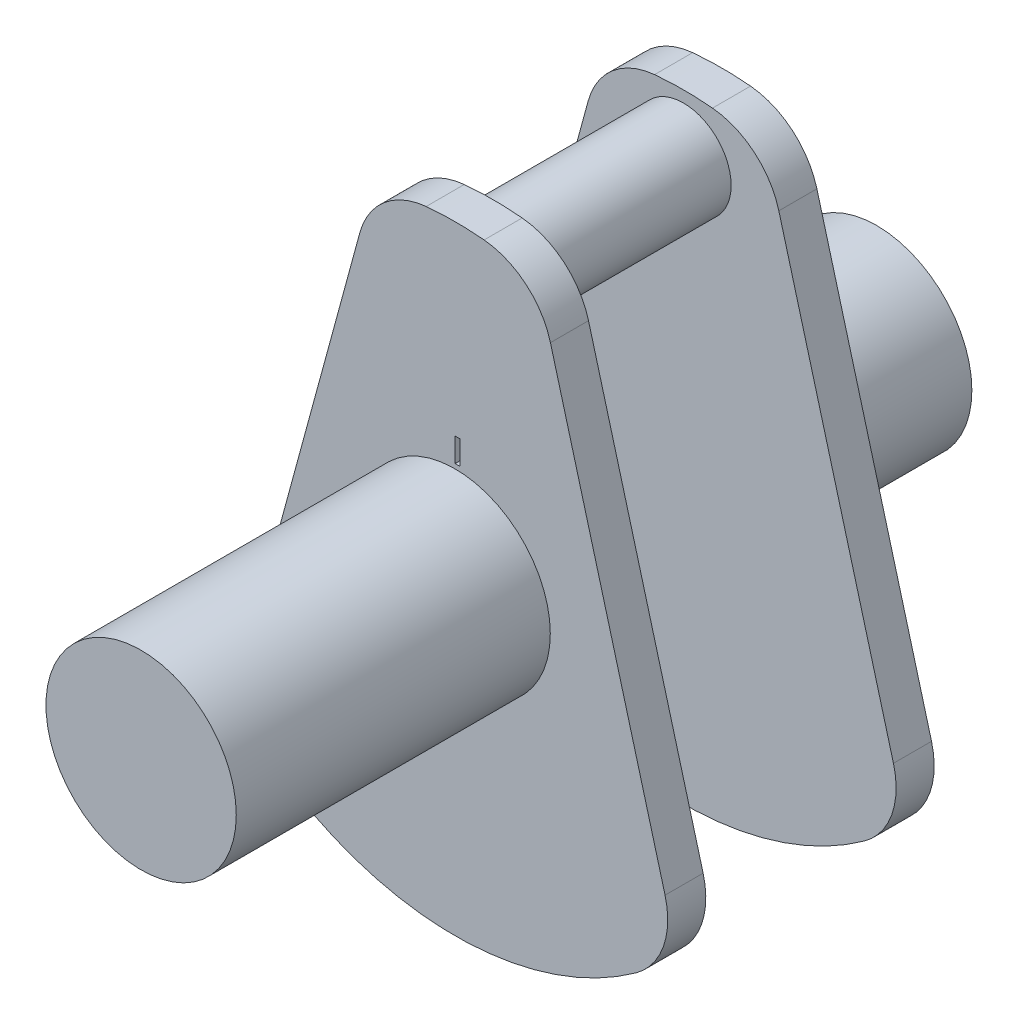
ISO-10303-21;
HEADER;
FILE_DESCRIPTION(('STEP AP214'),'2;1');
FILE_NAME('part.step','',(''),(''),'','','');
FILE_SCHEMA(('AUTOMOTIVE_DESIGN { 1 0 10303 214 1 1 1 1 }'));
ENDSEC;
DATA;
#1=APPLICATION_CONTEXT('core data for automotive mechanical design processes');
#2=APPLICATION_PROTOCOL_DEFINITION('international standard','automotive_design',2000,#1);
#3=PRODUCT_CONTEXT('',#1,'mechanical');
#4=PRODUCT('Part','Part','',(#3));
#5=PRODUCT_RELATED_PRODUCT_CATEGORY('part','',(#4));
#6=PRODUCT_DEFINITION_FORMATION('','',#4);
#7=PRODUCT_DEFINITION_CONTEXT('part definition',#1,'design');
#8=PRODUCT_DEFINITION('design','',#6,#7);
#9=PRODUCT_DEFINITION_SHAPE('','',#8);
#10=(LENGTH_UNIT() NAMED_UNIT(*) SI_UNIT(.MILLI.,.METRE.));
#11=(NAMED_UNIT(*) PLANE_ANGLE_UNIT() SI_UNIT($,.RADIAN.));
#12=(NAMED_UNIT(*) SI_UNIT($,.STERADIAN.) SOLID_ANGLE_UNIT());
#13=UNCERTAINTY_MEASURE_WITH_UNIT(LENGTH_MEASURE(1.E-05),#10,'distance_accuracy_value','');
#14=(GEOMETRIC_REPRESENTATION_CONTEXT(3) GLOBAL_UNCERTAINTY_ASSIGNED_CONTEXT((#13)) GLOBAL_UNIT_ASSIGNED_CONTEXT((#10,
#11,#12)) REPRESENTATION_CONTEXT('',''));
#15=CARTESIAN_POINT('',(0.,0.,0.));
#16=DIRECTION('',(0.,0.,1.));
#17=DIRECTION('',(1.,0.,0.));
#18=AXIS2_PLACEMENT_3D('',#15,#16,#17);
#19=CARTESIAN_POINT('',(0.459000000000004,3.78337793824868,36.9249720179287));
#20=DIRECTION('',(0.,0.,-1.));
#21=DIRECTION('',(-1.,0.,0.));
#22=AXIS2_PLACEMENT_3D('',#19,#20,#21);
#23=CYLINDRICAL_SURFACE('',#22,1.6);
#24=CARTESIAN_POINT('',(0.459000000000004,3.78337793824868,36.1249720179287));
#25=DIRECTION('',(0.,0.,1.));
#26=DIRECTION('',(1.,0.,0.));
#27=AXIS2_PLACEMENT_3D('',#24,#25,#26);
#28=CIRCLE('',#27,1.6);
#29=CARTESIAN_POINT('',(2.00284320160388,4.20355429272558,36.1249720179287));
#30=VERTEX_POINT('',#29);
#31=CARTESIAN_POINT('',(0.608877551020411,5.37634269608236,36.1249720179287));
#32=VERTEX_POINT('',#31);
#33=EDGE_CURVE('E156',#30,#32,#28,.T.);
#34=ORIENTED_EDGE('',*,*,#33,.T.);
#35=DIRECTION('',(0.,0.,-1.));
#36=VECTOR('',#35,1.);
#37=CARTESIAN_POINT('',(0.608877551020411,5.37634269608236,36.9249720179287));
#38=LINE('',#37,#36);
#39=CARTESIAN_POINT('',(0.608877551020411,5.37634269608236,36.9249720179287));
#40=VERTEX_POINT('',#39);
#41=EDGE_CURVE('E50',#40,#32,#38,.T.);
#42=ORIENTED_EDGE('',*,*,#41,.F.);
#43=CARTESIAN_POINT('',(0.459000000000004,3.78337793824868,36.9249720179287));
#44=DIRECTION('',(0.,0.,1.));
#45=DIRECTION('',(1.,0.,0.));
#46=AXIS2_PLACEMENT_3D('',#43,#44,#45);
#47=CIRCLE('',#46,1.6);
#48=CARTESIAN_POINT('',(2.00284320160388,4.20355429272558,36.9249720179287));
#49=VERTEX_POINT('',#48);
#50=EDGE_CURVE('E180',#49,#40,#47,.T.);
#51=ORIENTED_EDGE('',*,*,#50,.F.);
#52=DIRECTION('',(0.,0.,-1.));
#53=VECTOR('',#52,1.);
#54=CARTESIAN_POINT('',(2.00284320160388,4.20355429272558,36.9249720179287));
#55=LINE('',#54,#53);
#56=EDGE_CURVE('E152',#49,#30,#55,.T.);
#57=ORIENTED_EDGE('',*,*,#56,.T.);
#58=EDGE_LOOP('',(#34,#42,#51,#57));
#59=FACE_BOUND('',#58,.T.);
#60=ADVANCED_FACE('F42',(#59),#23,.T.);
#61=CARTESIAN_POINT('',(0.,-1.09507663261698,36.9249720179287));
#62=DIRECTION('',(0.,0.,-1.));
#63=DIRECTION('',(-1.,0.,0.));
#64=AXIS2_PLACEMENT_3D('',#61,#62,#63);
#65=CYLINDRICAL_SURFACE('',#64,6.5);
#66=CARTESIAN_POINT('',(0.,-1.09507663261698,36.1249720179287));
#67=DIRECTION('',(0.,0.,1.));
#68=DIRECTION('',(1.,0.,0.));
#69=AXIS2_PLACEMENT_3D('',#66,#67,#68);
#70=CIRCLE('',#69,6.5);
#71=CARTESIAN_POINT('',(-0.608877551020403,5.37634269608236,36.1249720179287));
#72=VERTEX_POINT('',#71);
#73=EDGE_CURVE('E160',#32,#72,#70,.T.);
#74=ORIENTED_EDGE('',*,*,#73,.T.);
#75=DIRECTION('',(0.,0.,-1.));
#76=VECTOR('',#75,1.);
#77=CARTESIAN_POINT('',(-0.608877551020403,5.37634269608236,36.9249720179287));
#78=LINE('',#77,#76);
#79=CARTESIAN_POINT('',(-0.608877551020403,5.37634269608236,36.9249720179287));
#80=VERTEX_POINT('',#79);
#81=EDGE_CURVE('E195',#80,#72,#78,.T.);
#82=ORIENTED_EDGE('',*,*,#81,.F.);
#83=CARTESIAN_POINT('',(0.,-1.09507663261698,36.9249720179287));
#84=DIRECTION('',(0.,0.,1.));
#85=DIRECTION('',(1.,0.,0.));
#86=AXIS2_PLACEMENT_3D('',#83,#84,#85);
#87=CIRCLE('',#86,6.5);
#88=EDGE_CURVE('E108',#40,#80,#87,.T.);
#89=ORIENTED_EDGE('',*,*,#88,.F.);
#90=ORIENTED_EDGE('',*,*,#41,.T.);
#91=EDGE_LOOP('',(#74,#82,#89,#90));
#92=FACE_BOUND('',#91,.T.);
#93=ADVANCED_FACE('F200',(#92),#65,.T.);
#94=CARTESIAN_POINT('',(-0.458999999999996,3.78337793824868,36.9249720179287));
#95=DIRECTION('',(0.,0.,-1.));
#96=DIRECTION('',(-1.,0.,0.));
#97=AXIS2_PLACEMENT_3D('',#94,#95,#96);
#98=CYLINDRICAL_SURFACE('',#97,1.6);
#99=CARTESIAN_POINT('',(-0.458999999999996,3.78337793824868,36.1249720179287));
#100=DIRECTION('',(0.,0.,1.));
#101=DIRECTION('',(-1.,0.,0.));
#102=AXIS2_PLACEMENT_3D('',#99,#100,#101);
#103=CIRCLE('',#102,1.6);
#104=CARTESIAN_POINT('',(-2.00284320160387,4.20355429272557,36.1249720179287));
#105=VERTEX_POINT('',#104);
#106=EDGE_CURVE('E164',#72,#105,#103,.T.);
#107=ORIENTED_EDGE('',*,*,#106,.T.);
#108=DIRECTION('',(0.,0.,-1.));
#109=VECTOR('',#108,1.);
#110=CARTESIAN_POINT('',(-2.00284320160387,4.20355429272557,36.9249720179287));
#111=LINE('',#110,#109);
#112=CARTESIAN_POINT('',(-2.00284320160387,4.20355429272557,36.9249720179287));
#113=VERTEX_POINT('',#112);
#114=EDGE_CURVE('E191',#113,#105,#111,.T.);
#115=ORIENTED_EDGE('',*,*,#114,.F.);
#116=CARTESIAN_POINT('',(-0.458999999999996,3.78337793824868,36.9249720179287));
#117=DIRECTION('',(0.,0.,1.));
#118=DIRECTION('',(-1.,0.,0.));
#119=AXIS2_PLACEMENT_3D('',#116,#117,#118);
#120=CIRCLE('',#119,1.6);
#121=EDGE_CURVE('E219',#80,#113,#120,.T.);
#122=ORIENTED_EDGE('',*,*,#121,.F.);
#123=ORIENTED_EDGE('',*,*,#81,.T.);
#124=EDGE_LOOP('',(#107,#115,#122,#123));
#125=FACE_BOUND('',#124,.T.);
#126=ADVANCED_FACE('F211',(#125),#98,.T.);
#127=CARTESIAN_POINT('',(-2.00284320160387,4.20355429272557,36.9249720179287));
#128=DIRECTION('',(0.964902001002423,-0.26261022154806,0.));
#129=DIRECTION('',(0.26261022154806,0.964902001002423,0.));
#130=AXIS2_PLACEMENT_3D('',#127,#128,#129);
#131=PLANE('',#130);
#132=DIRECTION('',(-0.26261022154806,-0.964902001002423,0.));
#133=VECTOR('',#132,1.);
#134=CARTESIAN_POINT('',(-2.00284320160387,4.20355429272557,36.1249720179287));
#135=LINE('',#134,#133);
#136=CARTESIAN_POINT('',(-4.41186786120332,-4.64786322182952,36.1249720179287));
#137=VERTEX_POINT('',#136);
#138=EDGE_CURVE('E167',#105,#137,#135,.T.);
#139=ORIENTED_EDGE('',*,*,#138,.T.);
#140=DIRECTION('',(0.,0.,-1.));
#141=VECTOR('',#140,1.);
#142=CARTESIAN_POINT('',(-4.41186786120332,-4.64786322182952,36.9249720179287));
#143=LINE('',#142,#141);
#144=CARTESIAN_POINT('',(-4.41186786120332,-4.64786322182952,36.9249720179287));
#145=VERTEX_POINT('',#144);
#146=EDGE_CURVE('E187',#145,#137,#143,.T.);
#147=ORIENTED_EDGE('',*,*,#146,.F.);
#148=DIRECTION('',(-0.26261022154806,-0.964902001002423,0.));
#149=VECTOR('',#148,1.);
#150=CARTESIAN_POINT('',(-2.00284320160387,4.20355429272557,36.9249720179287));
#151=LINE('',#150,#149);
#152=EDGE_CURVE('E217',#113,#145,#151,.T.);
#153=ORIENTED_EDGE('',*,*,#152,.F.);
#154=ORIENTED_EDGE('',*,*,#114,.T.);
#155=EDGE_LOOP('',(#139,#147,#153,#154));
#156=FACE_BOUND('',#155,.T.);
#157=ADVANCED_FACE('F215',(#156),#131,.F.);
#158=CARTESIAN_POINT('',(-2.86802465959945,-5.06803957630642,36.9249720179287));
#159=DIRECTION('',(0.,0.,-1.));
#160=DIRECTION('',(-1.,0.,0.));
#161=AXIS2_PLACEMENT_3D('',#158,#159,#160);
#162=CYLINDRICAL_SURFACE('',#161,1.6);
#163=CARTESIAN_POINT('',(-2.86802465959945,-5.06803957630642,36.1249720179287));
#164=DIRECTION('',(0.,0.,1.));
#165=DIRECTION('',(1.,0.,0.));
#166=AXIS2_PLACEMENT_3D('',#163,#164,#165);
#167=CIRCLE('',#166,1.6);
#168=CARTESIAN_POINT('',(-3.80452250763193,-6.36533359873562,36.1249720179287));
#169=VERTEX_POINT('',#168);
#170=EDGE_CURVE('E170',#137,#169,#167,.T.);
#171=ORIENTED_EDGE('',*,*,#170,.T.);
#172=DIRECTION('',(0.,0.,-1.));
#173=VECTOR('',#172,1.);
#174=CARTESIAN_POINT('',(-3.80452250763193,-6.36533359873562,36.9249720179287));
#175=LINE('',#174,#173);
#176=CARTESIAN_POINT('',(-3.80452250763193,-6.36533359873562,36.9249720179287));
#177=VERTEX_POINT('',#176);
#178=EDGE_CURVE('E145',#177,#169,#175,.T.);
#179=ORIENTED_EDGE('',*,*,#178,.F.);
#180=CARTESIAN_POINT('',(-2.86802465959945,-5.06803957630642,36.9249720179287));
#181=DIRECTION('',(0.,0.,1.));
#182=DIRECTION('',(1.,0.,0.));
#183=AXIS2_PLACEMENT_3D('',#180,#181,#182);
#184=CIRCLE('',#183,1.6);
#185=EDGE_CURVE('E131',#145,#177,#184,.T.);
#186=ORIENTED_EDGE('',*,*,#185,.F.);
#187=ORIENTED_EDGE('',*,*,#146,.T.);
#188=EDGE_LOOP('',(#171,#179,#186,#187));
#189=FACE_BOUND('',#188,.T.);
#190=ADVANCED_FACE('F506',(#189),#162,.T.);
#191=CARTESIAN_POINT('',(0.,-1.09507663261698,36.9249720179287));
#192=DIRECTION('',(0.,0.,-1.));
#193=DIRECTION('',(-1.,0.,0.));
#194=AXIS2_PLACEMENT_3D('',#191,#192,#193);
#195=CYLINDRICAL_SURFACE('',#194,6.5);
#196=CARTESIAN_POINT('',(0.,-1.09507663261698,36.1249720179287));
#197=DIRECTION('',(0.,0.,1.));
#198=DIRECTION('',(1.,0.,0.));
#199=AXIS2_PLACEMENT_3D('',#196,#197,#198);
#200=CIRCLE('',#199,6.5);
#201=CARTESIAN_POINT('',(3.80452250763193,-6.36533359873562,36.1249720179287));
#202=VERTEX_POINT('',#201);
#203=EDGE_CURVE('E141',#169,#202,#200,.T.);
#204=ORIENTED_EDGE('',*,*,#203,.T.);
#205=DIRECTION('',(0.,0.,-1.));
#206=VECTOR('',#205,1.);
#207=CARTESIAN_POINT('',(3.80452250763193,-6.36533359873562,36.9249720179287));
#208=LINE('',#207,#206);
#209=CARTESIAN_POINT('',(3.80452250763193,-6.36533359873562,36.9249720179287));
#210=VERTEX_POINT('',#209);
#211=EDGE_CURVE('E138',#210,#202,#208,.T.);
#212=ORIENTED_EDGE('',*,*,#211,.F.);
#213=CARTESIAN_POINT('',(0.,-1.09507663261698,36.9249720179287));
#214=DIRECTION('',(0.,0.,1.));
#215=DIRECTION('',(1.,0.,0.));
#216=AXIS2_PLACEMENT_3D('',#213,#214,#215);
#217=CIRCLE('',#216,6.5);
#218=EDGE_CURVE('E124',#177,#210,#217,.T.);
#219=ORIENTED_EDGE('',*,*,#218,.F.);
#220=ORIENTED_EDGE('',*,*,#178,.T.);
#221=EDGE_LOOP('',(#204,#212,#219,#220));
#222=FACE_BOUND('',#221,.T.);
#223=ADVANCED_FACE('F139',(#222),#195,.T.);
#224=CARTESIAN_POINT('',(2.86802465959946,-5.06803957630641,36.9249720179287));
#225=DIRECTION('',(0.,0.,-1.));
#226=DIRECTION('',(-1.,0.,0.));
#227=AXIS2_PLACEMENT_3D('',#224,#225,#226);
#228=CYLINDRICAL_SURFACE('',#227,1.6);
#229=CARTESIAN_POINT('',(2.86802465959946,-5.06803957630641,36.1249720179287));
#230=DIRECTION('',(0.,0.,1.));
#231=DIRECTION('',(-1.,0.,0.));
#232=AXIS2_PLACEMENT_3D('',#229,#230,#231);
#233=CIRCLE('',#232,1.6);
#234=CARTESIAN_POINT('',(4.41186786120333,-4.64786322182952,36.1249720179287));
#235=VERTEX_POINT('',#234);
#236=EDGE_CURVE('E175',#202,#235,#233,.T.);
#237=ORIENTED_EDGE('',*,*,#236,.T.);
#238=DIRECTION('',(0.,0.,-1.));
#239=VECTOR('',#238,1.);
#240=CARTESIAN_POINT('',(4.41186786120333,-4.64786322182952,36.9249720179287));
#241=LINE('',#240,#239);
#242=CARTESIAN_POINT('',(4.41186786120333,-4.64786322182952,36.9249720179287));
#243=VERTEX_POINT('',#242);
#244=EDGE_CURVE('E146',#243,#235,#241,.T.);
#245=ORIENTED_EDGE('',*,*,#244,.F.);
#246=CARTESIAN_POINT('',(2.86802465959946,-5.06803957630641,36.9249720179287));
#247=DIRECTION('',(0.,0.,1.));
#248=DIRECTION('',(-1.,0.,0.));
#249=AXIS2_PLACEMENT_3D('',#246,#247,#248);
#250=CIRCLE('',#249,1.6);
#251=EDGE_CURVE('E128',#210,#243,#250,.T.);
#252=ORIENTED_EDGE('',*,*,#251,.F.);
#253=ORIENTED_EDGE('',*,*,#211,.T.);
#254=EDGE_LOOP('',(#237,#245,#252,#253));
#255=FACE_BOUND('',#254,.T.);
#256=ADVANCED_FACE('F148',(#255),#228,.T.);
#257=CARTESIAN_POINT('',(2.00284320160388,4.20355429272558,36.9249720179287));
#258=DIRECTION('',(-0.964902001002423,-0.26261022154806,0.));
#259=DIRECTION('',(0.26261022154806,-0.964902001002423,0.));
#260=AXIS2_PLACEMENT_3D('',#257,#258,#259);
#261=PLANE('',#260);
#262=DIRECTION('',(-0.26261022154806,0.964902001002423,0.));
#263=VECTOR('',#262,1.);
#264=CARTESIAN_POINT('',(2.00284320160388,4.20355429272558,36.1249720179287));
#265=LINE('',#264,#263);
#266=EDGE_CURVE('E99',#235,#30,#265,.T.);
#267=ORIENTED_EDGE('',*,*,#266,.T.);
#268=ORIENTED_EDGE('',*,*,#56,.F.);
#269=DIRECTION('',(-0.26261022154806,0.964902001002423,0.));
#270=VECTOR('',#269,1.);
#271=CARTESIAN_POINT('',(2.00284320160388,4.20355429272558,36.9249720179287));
#272=LINE('',#271,#270);
#273=EDGE_CURVE('E66',#243,#49,#272,.T.);
#274=ORIENTED_EDGE('',*,*,#273,.F.);
#275=ORIENTED_EDGE('',*,*,#244,.T.);
#276=EDGE_LOOP('',(#267,#268,#274,#275));
#277=FACE_BOUND('',#276,.T.);
#278=ADVANCED_FACE('F514',(#277),#261,.F.);
#279=CARTESIAN_POINT('',(0.459000000000004,3.78337793824868,36.9249720179287));
#280=DIRECTION('',(0.,0.,1.));
#281=DIRECTION('',(1.,0.,0.));
#282=AXIS2_PLACEMENT_3D('',#279,#280,#281);
#283=PLANE('',#282);
#284=CARTESIAN_POINT('',(0.,4.16392336738302,36.9249720179287));
#285=DIRECTION('',(0.,0.,1.));
#286=DIRECTION('',(1.,0.,0.));
#287=AXIS2_PLACEMENT_3D('',#284,#285,#286);
#288=CIRCLE('',#287,1.);
#289=CARTESIAN_POINT('',(1.00000000000001,4.16392336738302,36.9249720179287));
#290=VERTEX_POINT('',#289);
#291=EDGE_CURVE('E161',#290,#290,#288,.T.);
#292=ORIENTED_EDGE('',*,*,#291,.F.);
#293=EDGE_LOOP('',(#292));
#294=FACE_BOUND('',#293,.T.);
#295=ORIENTED_EDGE('',*,*,#50,.T.);
#296=ORIENTED_EDGE('',*,*,#88,.T.);
#297=ORIENTED_EDGE('',*,*,#121,.T.);
#298=ORIENTED_EDGE('',*,*,#152,.T.);
#299=ORIENTED_EDGE('',*,*,#185,.T.);
#300=ORIENTED_EDGE('',*,*,#218,.T.);
#301=ORIENTED_EDGE('',*,*,#251,.T.);
#302=ORIENTED_EDGE('',*,*,#273,.T.);
#303=EDGE_LOOP('',(#295,#296,#297,#298,#299,#300,#301,#302));
#304=FACE_BOUND('',#303,.T.);
#305=ADVANCED_FACE('F126',(#294,#304),#283,.T.);
#306=CARTESIAN_POINT('',(0.459000000000004,3.78337793824868,36.1249720179287));
#307=DIRECTION('',(0.,0.,1.));
#308=DIRECTION('',(1.,0.,0.));
#309=AXIS2_PLACEMENT_3D('',#306,#307,#308);
#310=PLANE('',#309);
#311=CARTESIAN_POINT('',(0.,-1.09507663261698,36.1249720179287));
#312=DIRECTION('',(0.,0.,1.));
#313=DIRECTION('',(1.,0.,0.));
#314=AXIS2_PLACEMENT_3D('',#311,#312,#313);
#315=CIRCLE('',#314,2.);
#316=CARTESIAN_POINT('',(2.,-1.09507663261698,36.1249720179287));
#317=VERTEX_POINT('',#316);
#318=EDGE_CURVE('E11',#317,#317,#315,.F.);
#319=ORIENTED_EDGE('',*,*,#318,.F.);
#320=EDGE_LOOP('',(#319));
#321=FACE_BOUND('',#320,.T.);
#322=ORIENTED_EDGE('',*,*,#33,.F.);
#323=ORIENTED_EDGE('',*,*,#266,.F.);
#324=ORIENTED_EDGE('',*,*,#236,.F.);
#325=ORIENTED_EDGE('',*,*,#203,.F.);
#326=ORIENTED_EDGE('',*,*,#170,.F.);
#327=ORIENTED_EDGE('',*,*,#138,.F.);
#328=ORIENTED_EDGE('',*,*,#106,.F.);
#329=ORIENTED_EDGE('',*,*,#73,.F.);
#330=EDGE_LOOP('',(#322,#323,#324,#325,#326,#327,#328,#329));
#331=FACE_BOUND('',#330,.T.);
#332=ADVANCED_FACE('F205',(#321,#331),#310,.F.);
#333=CARTESIAN_POINT('',(0.,4.16392336738302,38.9249720179287));
#334=DIRECTION('',(0.,0.,-1.));
#335=DIRECTION('',(-1.,0.,0.));
#336=AXIS2_PLACEMENT_3D('',#333,#334,#335);
#337=CYLINDRICAL_SURFACE('',#336,1.);
#338=ORIENTED_EDGE('',*,*,#291,.T.);
#339=EDGE_LOOP('',(#338));
#340=FACE_BOUND('',#339,.T.);
#341=CARTESIAN_POINT('',(0.,4.16392336738302,40.9249720179287));
#342=DIRECTION('',(0.,0.,1.));
#343=DIRECTION('',(1.,0.,0.));
#344=AXIS2_PLACEMENT_3D('',#341,#342,#343);
#345=CIRCLE('',#344,1.);
#346=CARTESIAN_POINT('',(1.00000000000001,4.16392336738302,40.9249720179287));
#347=VERTEX_POINT('',#346);
#348=EDGE_CURVE('E306',#347,#347,#345,.T.);
#349=ORIENTED_EDGE('',*,*,#348,.F.);
#350=EDGE_LOOP('',(#349));
#351=FACE_BOUND('',#350,.T.);
#352=ADVANCED_FACE('F519',(#340,#351),#337,.T.);
#353=CARTESIAN_POINT('',(0.,-1.09507663261698,32.8649720179287));
#354=DIRECTION('',(0.,0.,1.));
#355=DIRECTION('',(1.,0.,0.));
#356=AXIS2_PLACEMENT_3D('',#353,#354,#355);
#357=CYLINDRICAL_SURFACE('',#356,2.);
#358=CARTESIAN_POINT('',(0.,-1.09507663261698,32.8649720179287));
#359=DIRECTION('',(0.,0.,-1.));
#360=DIRECTION('',(-1.,0.,0.));
#361=AXIS2_PLACEMENT_3D('',#358,#359,#360);
#362=CIRCLE('',#361,2.);
#363=CARTESIAN_POINT('',(-2.,-1.09507663261698,32.8649720179287));
#364=VERTEX_POINT('',#363);
#365=EDGE_CURVE('E232',#364,#364,#362,.T.);
#366=ORIENTED_EDGE('',*,*,#365,.F.);
#367=EDGE_LOOP('',(#366));
#368=FACE_BOUND('',#367,.T.);
#369=ORIENTED_EDGE('',*,*,#318,.T.);
#370=EDGE_LOOP('',(#369));
#371=FACE_BOUND('',#370,.T.);
#372=ADVANCED_FACE('F526',(#368,#371),#357,.T.);
#373=CARTESIAN_POINT('',(0.,-1.09507663261698,32.8649720179287));
#374=DIRECTION('',(0.,0.,-1.));
#375=DIRECTION('',(-1.,0.,0.));
#376=AXIS2_PLACEMENT_3D('',#373,#374,#375);
#377=PLANE('',#376);
#378=ORIENTED_EDGE('',*,*,#365,.T.);
#379=EDGE_LOOP('',(#378));
#380=FACE_BOUND('',#379,.T.);
#381=ADVANCED_FACE('F530',(#380),#377,.T.);
#382=CARTESIAN_POINT('',(0.459000000000004,3.78337793824868,40.9249720179287));
#383=DIRECTION('',(0.,0.,1.));
#384=DIRECTION('',(-1.,0.,0.));
#385=AXIS2_PLACEMENT_3D('',#382,#383,#384);
#386=CYLINDRICAL_SURFACE('',#385,1.6);
#387=CARTESIAN_POINT('',(0.459000000000004,3.78337793824868,41.7249720179287));
#388=DIRECTION('',(0.,0.,1.));
#389=DIRECTION('',(1.,0.,0.));
#390=AXIS2_PLACEMENT_3D('',#387,#388,#389);
#391=CIRCLE('',#390,1.6);
#392=CARTESIAN_POINT('',(2.00284320160388,4.20355429272558,41.7249720179287));
#393=VERTEX_POINT('',#392);
#394=CARTESIAN_POINT('',(0.608877551020411,5.37634269608236,41.7249720179287));
#395=VERTEX_POINT('',#394);
#396=EDGE_CURVE('E302',#393,#395,#391,.T.);
#397=ORIENTED_EDGE('',*,*,#396,.F.);
#398=DIRECTION('',(0.,0.,1.));
#399=VECTOR('',#398,1.);
#400=CARTESIAN_POINT('',(2.00284320160388,4.20355429272558,40.9249720179287));
#401=LINE('',#400,#399);
#402=CARTESIAN_POINT('',(2.00284320160388,4.20355429272558,40.9249720179287));
#403=VERTEX_POINT('',#402);
#404=EDGE_CURVE('E268',#403,#393,#401,.T.);
#405=ORIENTED_EDGE('',*,*,#404,.F.);
#406=CARTESIAN_POINT('',(0.459000000000004,3.78337793824868,40.9249720179287));
#407=DIRECTION('',(0.,0.,1.));
#408=DIRECTION('',(1.,0.,0.));
#409=AXIS2_PLACEMENT_3D('',#406,#407,#408);
#410=CIRCLE('',#409,1.6);
#411=CARTESIAN_POINT('',(0.608877551020411,5.37634269608236,40.9249720179287));
#412=VERTEX_POINT('',#411);
#413=EDGE_CURVE('E277',#403,#412,#410,.T.);
#414=ORIENTED_EDGE('',*,*,#413,.T.);
#415=DIRECTION('',(0.,0.,1.));
#416=VECTOR('',#415,1.);
#417=CARTESIAN_POINT('',(0.608877551020411,5.37634269608236,40.9249720179287));
#418=LINE('',#417,#416);
#419=EDGE_CURVE('E240',#412,#395,#418,.T.);
#420=ORIENTED_EDGE('',*,*,#419,.T.);
#421=EDGE_LOOP('',(#397,#405,#414,#420));
#422=FACE_BOUND('',#421,.T.);
#423=ADVANCED_FACE('F461',(#422),#386,.T.);
#424=CARTESIAN_POINT('',(0.,-1.09507663261698,40.9249720179287));
#425=DIRECTION('',(0.,0.,1.));
#426=DIRECTION('',(-1.,0.,0.));
#427=AXIS2_PLACEMENT_3D('',#424,#425,#426);
#428=CYLINDRICAL_SURFACE('',#427,6.5);
#429=CARTESIAN_POINT('',(0.,-1.09507663261698,41.7249720179287));
#430=DIRECTION('',(0.,0.,1.));
#431=DIRECTION('',(1.,0.,0.));
#432=AXIS2_PLACEMENT_3D('',#429,#430,#431);
#433=CIRCLE('',#432,6.5);
#434=CARTESIAN_POINT('',(-0.608877551020403,5.37634269608236,41.7249720179287));
#435=VERTEX_POINT('',#434);
#436=EDGE_CURVE('E298',#395,#435,#433,.T.);
#437=ORIENTED_EDGE('',*,*,#436,.F.);
#438=ORIENTED_EDGE('',*,*,#419,.F.);
#439=CARTESIAN_POINT('',(0.,-1.09507663261698,40.9249720179287));
#440=DIRECTION('',(0.,0.,1.));
#441=DIRECTION('',(1.,0.,0.));
#442=AXIS2_PLACEMENT_3D('',#439,#440,#441);
#443=CIRCLE('',#442,6.5);
#444=CARTESIAN_POINT('',(-0.608877551020403,5.37634269608236,40.9249720179287));
#445=VERTEX_POINT('',#444);
#446=EDGE_CURVE('E330',#412,#445,#443,.T.);
#447=ORIENTED_EDGE('',*,*,#446,.T.);
#448=DIRECTION('',(0.,0.,1.));
#449=VECTOR('',#448,1.);
#450=CARTESIAN_POINT('',(-0.608877551020403,5.37634269608236,40.9249720179287));
#451=LINE('',#450,#449);
#452=EDGE_CURVE('E244',#445,#435,#451,.T.);
#453=ORIENTED_EDGE('',*,*,#452,.T.);
#454=EDGE_LOOP('',(#437,#438,#447,#453));
#455=FACE_BOUND('',#454,.T.);
#456=ADVANCED_FACE('F464',(#455),#428,.T.);
#457=CARTESIAN_POINT('',(-0.458999999999996,3.78337793824868,40.9249720179287));
#458=DIRECTION('',(0.,0.,1.));
#459=DIRECTION('',(-1.,0.,0.));
#460=AXIS2_PLACEMENT_3D('',#457,#458,#459);
#461=CYLINDRICAL_SURFACE('',#460,1.6);
#462=CARTESIAN_POINT('',(-0.458999999999996,3.78337793824868,41.7249720179287));
#463=DIRECTION('',(0.,0.,1.));
#464=DIRECTION('',(-1.,0.,0.));
#465=AXIS2_PLACEMENT_3D('',#462,#463,#464);
#466=CIRCLE('',#465,1.6);
#467=CARTESIAN_POINT('',(-2.00284320160387,4.20355429272557,41.7249720179287));
#468=VERTEX_POINT('',#467);
#469=EDGE_CURVE('E294',#435,#468,#466,.T.);
#470=ORIENTED_EDGE('',*,*,#469,.F.);
#471=ORIENTED_EDGE('',*,*,#452,.F.);
#472=CARTESIAN_POINT('',(-0.458999999999996,3.78337793824868,40.9249720179287));
#473=DIRECTION('',(0.,0.,1.));
#474=DIRECTION('',(-1.,0.,0.));
#475=AXIS2_PLACEMENT_3D('',#472,#473,#474);
#476=CIRCLE('',#475,1.6);
#477=CARTESIAN_POINT('',(-2.00284320160387,4.20355429272557,40.9249720179287));
#478=VERTEX_POINT('',#477);
#479=EDGE_CURVE('E326',#445,#478,#476,.T.);
#480=ORIENTED_EDGE('',*,*,#479,.T.);
#481=DIRECTION('',(0.,0.,1.));
#482=VECTOR('',#481,1.);
#483=CARTESIAN_POINT('',(-2.00284320160387,4.20355429272557,40.9249720179287));
#484=LINE('',#483,#482);
#485=EDGE_CURVE('E248',#478,#468,#484,.T.);
#486=ORIENTED_EDGE('',*,*,#485,.T.);
#487=EDGE_LOOP('',(#470,#471,#480,#486));
#488=FACE_BOUND('',#487,.T.);
#489=ADVANCED_FACE('F467',(#488),#461,.T.);
#490=CARTESIAN_POINT('',(-2.00284320160387,4.20355429272557,40.9249720179287));
#491=DIRECTION('',(0.964902001002423,-0.26261022154806,0.));
#492=DIRECTION('',(0.26261022154806,0.964902001002423,0.));
#493=AXIS2_PLACEMENT_3D('',#490,#491,#492);
#494=PLANE('',#493);
#495=DIRECTION('',(-0.26261022154806,-0.964902001002423,0.));
#496=VECTOR('',#495,1.);
#497=CARTESIAN_POINT('',(-2.00284320160387,4.20355429272557,41.7249720179287));
#498=LINE('',#497,#496);
#499=CARTESIAN_POINT('',(-4.41186786120332,-4.64786322182952,41.7249720179287));
#500=VERTEX_POINT('',#499);
#501=EDGE_CURVE('E290',#468,#500,#498,.T.);
#502=ORIENTED_EDGE('',*,*,#501,.F.);
#503=ORIENTED_EDGE('',*,*,#485,.F.);
#504=DIRECTION('',(-0.26261022154806,-0.964902001002423,0.));
#505=VECTOR('',#504,1.);
#506=CARTESIAN_POINT('',(-2.00284320160387,4.20355429272557,40.9249720179287));
#507=LINE('',#506,#505);
#508=CARTESIAN_POINT('',(-4.41186786120332,-4.64786322182952,40.9249720179287));
#509=VERTEX_POINT('',#508);
#510=EDGE_CURVE('E322',#478,#509,#507,.T.);
#511=ORIENTED_EDGE('',*,*,#510,.T.);
#512=DIRECTION('',(0.,0.,1.));
#513=VECTOR('',#512,1.);
#514=CARTESIAN_POINT('',(-4.41186786120332,-4.64786322182952,40.9249720179287));
#515=LINE('',#514,#513);
#516=EDGE_CURVE('E252',#509,#500,#515,.T.);
#517=ORIENTED_EDGE('',*,*,#516,.T.);
#518=EDGE_LOOP('',(#502,#503,#511,#517));
#519=FACE_BOUND('',#518,.T.);
#520=ADVANCED_FACE('F470',(#519),#494,.F.);
#521=CARTESIAN_POINT('',(-2.86802465959945,-5.06803957630642,40.9249720179287));
#522=DIRECTION('',(0.,0.,1.));
#523=DIRECTION('',(-1.,0.,0.));
#524=AXIS2_PLACEMENT_3D('',#521,#522,#523);
#525=CYLINDRICAL_SURFACE('',#524,1.6);
#526=CARTESIAN_POINT('',(-2.86802465959945,-5.06803957630642,41.7249720179287));
#527=DIRECTION('',(0.,0.,1.));
#528=DIRECTION('',(1.,0.,0.));
#529=AXIS2_PLACEMENT_3D('',#526,#527,#528);
#530=CIRCLE('',#529,1.6);
#531=CARTESIAN_POINT('',(-3.80452250763193,-6.36533359873562,41.7249720179287));
#532=VERTEX_POINT('',#531);
#533=EDGE_CURVE('E286',#500,#532,#530,.T.);
#534=ORIENTED_EDGE('',*,*,#533,.F.);
#535=ORIENTED_EDGE('',*,*,#516,.F.);
#536=CARTESIAN_POINT('',(-2.86802465959945,-5.06803957630642,40.9249720179287));
#537=DIRECTION('',(0.,0.,1.));
#538=DIRECTION('',(1.,0.,0.));
#539=AXIS2_PLACEMENT_3D('',#536,#537,#538);
#540=CIRCLE('',#539,1.6);
#541=CARTESIAN_POINT('',(-3.80452250763193,-6.36533359873562,40.9249720179287));
#542=VERTEX_POINT('',#541);
#543=EDGE_CURVE('E318',#509,#542,#540,.T.);
#544=ORIENTED_EDGE('',*,*,#543,.T.);
#545=DIRECTION('',(0.,0.,1.));
#546=VECTOR('',#545,1.);
#547=CARTESIAN_POINT('',(-3.80452250763193,-6.36533359873562,40.9249720179287));
#548=LINE('',#547,#546);
#549=EDGE_CURVE('E256',#542,#532,#548,.T.);
#550=ORIENTED_EDGE('',*,*,#549,.T.);
#551=EDGE_LOOP('',(#534,#535,#544,#550));
#552=FACE_BOUND('',#551,.T.);
#553=ADVANCED_FACE('F473',(#552),#525,.T.);
#554=CARTESIAN_POINT('',(0.,-1.09507663261698,40.9249720179287));
#555=DIRECTION('',(0.,0.,1.));
#556=DIRECTION('',(-1.,0.,0.));
#557=AXIS2_PLACEMENT_3D('',#554,#555,#556);
#558=CYLINDRICAL_SURFACE('',#557,6.5);
#559=CARTESIAN_POINT('',(0.,-1.09507663261698,41.7249720179287));
#560=DIRECTION('',(0.,0.,1.));
#561=DIRECTION('',(1.,0.,0.));
#562=AXIS2_PLACEMENT_3D('',#559,#560,#561);
#563=CIRCLE('',#562,6.5);
#564=CARTESIAN_POINT('',(3.80452250763193,-6.36533359873562,41.7249720179287));
#565=VERTEX_POINT('',#564);
#566=EDGE_CURVE('E282',#532,#565,#563,.T.);
#567=ORIENTED_EDGE('',*,*,#566,.F.);
#568=ORIENTED_EDGE('',*,*,#549,.F.);
#569=CARTESIAN_POINT('',(0.,-1.09507663261698,40.9249720179287));
#570=DIRECTION('',(0.,0.,1.));
#571=DIRECTION('',(1.,0.,0.));
#572=AXIS2_PLACEMENT_3D('',#569,#570,#571);
#573=CIRCLE('',#572,6.5);
#574=CARTESIAN_POINT('',(3.80452250763193,-6.36533359873562,40.9249720179287));
#575=VERTEX_POINT('',#574);
#576=EDGE_CURVE('E314',#542,#575,#573,.T.);
#577=ORIENTED_EDGE('',*,*,#576,.T.);
#578=DIRECTION('',(0.,0.,1.));
#579=VECTOR('',#578,1.);
#580=CARTESIAN_POINT('',(3.80452250763193,-6.36533359873562,40.9249720179287));
#581=LINE('',#580,#579);
#582=EDGE_CURVE('E260',#575,#565,#581,.T.);
#583=ORIENTED_EDGE('',*,*,#582,.T.);
#584=EDGE_LOOP('',(#567,#568,#577,#583));
#585=FACE_BOUND('',#584,.T.);
#586=ADVANCED_FACE('F476',(#585),#558,.T.);
#587=CARTESIAN_POINT('',(2.86802465959946,-5.06803957630641,40.9249720179287));
#588=DIRECTION('',(0.,0.,1.));
#589=DIRECTION('',(-1.,0.,0.));
#590=AXIS2_PLACEMENT_3D('',#587,#588,#589);
#591=CYLINDRICAL_SURFACE('',#590,1.6);
#592=CARTESIAN_POINT('',(2.86802465959946,-5.06803957630641,41.7249720179287));
#593=DIRECTION('',(0.,0.,1.));
#594=DIRECTION('',(-1.,0.,0.));
#595=AXIS2_PLACEMENT_3D('',#592,#593,#594);
#596=CIRCLE('',#595,1.6);
#597=CARTESIAN_POINT('',(4.41186786120333,-4.64786322182952,41.7249720179287));
#598=VERTEX_POINT('',#597);
#599=EDGE_CURVE('E278',#565,#598,#596,.T.);
#600=ORIENTED_EDGE('',*,*,#599,.F.);
#601=ORIENTED_EDGE('',*,*,#582,.F.);
#602=CARTESIAN_POINT('',(2.86802465959946,-5.06803957630641,40.9249720179287));
#603=DIRECTION('',(0.,0.,1.));
#604=DIRECTION('',(-1.,0.,0.));
#605=AXIS2_PLACEMENT_3D('',#602,#603,#604);
#606=CIRCLE('',#605,1.6);
#607=CARTESIAN_POINT('',(4.41186786120333,-4.64786322182952,40.9249720179287));
#608=VERTEX_POINT('',#607);
#609=EDGE_CURVE('E310',#575,#608,#606,.T.);
#610=ORIENTED_EDGE('',*,*,#609,.T.);
#611=DIRECTION('',(0.,0.,1.));
#612=VECTOR('',#611,1.);
#613=CARTESIAN_POINT('',(4.41186786120333,-4.64786322182952,40.9249720179287));
#614=LINE('',#613,#612);
#615=EDGE_CURVE('E264',#608,#598,#614,.T.);
#616=ORIENTED_EDGE('',*,*,#615,.T.);
#617=EDGE_LOOP('',(#600,#601,#610,#616));
#618=FACE_BOUND('',#617,.T.);
#619=ADVANCED_FACE('F479',(#618),#591,.T.);
#620=CARTESIAN_POINT('',(2.00284320160388,4.20355429272558,40.9249720179287));
#621=DIRECTION('',(-0.964902001002423,-0.26261022154806,0.));
#622=DIRECTION('',(0.26261022154806,-0.964902001002423,0.));
#623=AXIS2_PLACEMENT_3D('',#620,#621,#622);
#624=PLANE('',#623);
#625=DIRECTION('',(-0.26261022154806,0.964902001002423,0.));
#626=VECTOR('',#625,1.);
#627=CARTESIAN_POINT('',(2.00284320160388,4.20355429272558,41.7249720179287));
#628=LINE('',#627,#626);
#629=EDGE_CURVE('E273',#598,#393,#628,.T.);
#630=ORIENTED_EDGE('',*,*,#629,.F.);
#631=ORIENTED_EDGE('',*,*,#615,.F.);
#632=DIRECTION('',(-0.26261022154806,0.964902001002423,0.));
#633=VECTOR('',#632,1.);
#634=CARTESIAN_POINT('',(2.00284320160388,4.20355429272558,40.9249720179287));
#635=LINE('',#634,#633);
#636=EDGE_CURVE('E272',#608,#403,#635,.T.);
#637=ORIENTED_EDGE('',*,*,#636,.T.);
#638=ORIENTED_EDGE('',*,*,#404,.T.);
#639=EDGE_LOOP('',(#630,#631,#637,#638));
#640=FACE_BOUND('',#639,.T.);
#641=ADVANCED_FACE('F458',(#640),#624,.F.);
#642=CARTESIAN_POINT('',(0.459000000000004,3.78337793824868,40.9249720179287));
#643=DIRECTION('',(0.,0.,-1.));
#644=DIRECTION('',(1.,0.,0.));
#645=AXIS2_PLACEMENT_3D('',#642,#643,#644);
#646=PLANE('',#645);
#647=ORIENTED_EDGE('',*,*,#348,.T.);
#648=EDGE_LOOP('',(#647));
#649=FACE_BOUND('',#648,.T.);
#650=ORIENTED_EDGE('',*,*,#413,.F.);
#651=ORIENTED_EDGE('',*,*,#636,.F.);
#652=ORIENTED_EDGE('',*,*,#609,.F.);
#653=ORIENTED_EDGE('',*,*,#576,.F.);
#654=ORIENTED_EDGE('',*,*,#543,.F.);
#655=ORIENTED_EDGE('',*,*,#510,.F.);
#656=ORIENTED_EDGE('',*,*,#479,.F.);
#657=ORIENTED_EDGE('',*,*,#446,.F.);
#658=EDGE_LOOP('',(#650,#651,#652,#653,#654,#655,#656,#657));
#659=FACE_BOUND('',#658,.T.);
#660=ADVANCED_FACE('F481',(#649,#659),#646,.T.);
#661=CARTESIAN_POINT('',(0.459000000000004,3.78337793824868,41.7249720179287));
#662=DIRECTION('',(0.,0.,-1.));
#663=DIRECTION('',(1.,0.,0.));
#664=AXIS2_PLACEMENT_3D('',#661,#662,#663);
#665=PLANE('',#664);
#666=DIRECTION('',(1.,0.,0.));
#667=VECTOR('',#666,1.);
#668=CARTESIAN_POINT('',(0.,1.00174548209462,41.7249720179287));
#669=LINE('',#668,#667);
#670=CARTESIAN_POINT('',(0.,1.00174548209462,41.7249720179287));
#671=VERTEX_POINT('',#670);
#672=CARTESIAN_POINT('',(0.1,1.00174548209462,41.7249720179287));
#673=VERTEX_POINT('',#672);
#674=EDGE_CURVE('E368',#671,#673,#669,.T.);
#675=ORIENTED_EDGE('',*,*,#674,.F.);
#676=DIRECTION('',(0.,-1.,0.));
#677=VECTOR('',#676,1.);
#678=CARTESIAN_POINT('',(0.,1.50174548209462,41.7249720179287));
#679=LINE('',#678,#677);
#680=CARTESIAN_POINT('',(0.,1.50174548209462,41.7249720179287));
#681=VERTEX_POINT('',#680);
#682=EDGE_CURVE('E57',#681,#671,#679,.T.);
#683=ORIENTED_EDGE('',*,*,#682,.F.);
#684=DIRECTION('',(-1.,0.,0.));
#685=VECTOR('',#684,1.);
#686=CARTESIAN_POINT('',(0.,1.50174548209462,41.7249720179287));
#687=LINE('',#686,#685);
#688=CARTESIAN_POINT('',(0.1,1.50174548209462,41.7249720179287));
#689=VERTEX_POINT('',#688);
#690=EDGE_CURVE('E359',#689,#681,#687,.T.);
#691=ORIENTED_EDGE('',*,*,#690,.F.);
#692=DIRECTION('',(0.,1.,0.));
#693=VECTOR('',#692,1.);
#694=CARTESIAN_POINT('',(0.1,1.50174548209462,41.7249720179287));
#695=LINE('',#694,#693);
#696=EDGE_CURVE('E364',#673,#689,#695,.T.);
#697=ORIENTED_EDGE('',*,*,#696,.F.);
#698=EDGE_LOOP('',(#675,#683,#691,#697));
#699=FACE_BOUND('',#698,.T.);
#700=CARTESIAN_POINT('',(0.,-1.09507663261698,41.7249720179287));
#701=DIRECTION('',(0.,0.,1.));
#702=DIRECTION('',(1.,0.,0.));
#703=AXIS2_PLACEMENT_3D('',#700,#701,#702);
#704=CIRCLE('',#703,2.);
#705=CARTESIAN_POINT('',(2.,-1.09507663261698,41.7249720179287));
#706=VERTEX_POINT('',#705);
#707=EDGE_CURVE('E236',#706,#706,#704,.F.);
#708=ORIENTED_EDGE('',*,*,#707,.T.);
#709=EDGE_LOOP('',(#708));
#710=FACE_BOUND('',#709,.T.);
#711=ORIENTED_EDGE('',*,*,#396,.T.);
#712=ORIENTED_EDGE('',*,*,#436,.T.);
#713=ORIENTED_EDGE('',*,*,#469,.T.);
#714=ORIENTED_EDGE('',*,*,#501,.T.);
#715=ORIENTED_EDGE('',*,*,#533,.T.);
#716=ORIENTED_EDGE('',*,*,#566,.T.);
#717=ORIENTED_EDGE('',*,*,#599,.T.);
#718=ORIENTED_EDGE('',*,*,#629,.T.);
#719=EDGE_LOOP('',(#711,#712,#713,#714,#715,#716,#717,#718));
#720=FACE_BOUND('',#719,.T.);
#721=ADVANCED_FACE('F455',(#699,#710,#720),#665,.F.);
#722=CARTESIAN_POINT('',(0.,-1.09507663261698,44.9849720179287));
#723=DIRECTION('',(0.,0.,-1.));
#724=DIRECTION('',(1.,0.,0.));
#725=AXIS2_PLACEMENT_3D('',#722,#723,#724);
#726=CYLINDRICAL_SURFACE('',#725,2.);
#727=ORIENTED_EDGE('',*,*,#707,.F.);
#728=EDGE_LOOP('',(#727));
#729=FACE_BOUND('',#728,.T.);
#730=CARTESIAN_POINT('',(0.,-1.09507663261698,48.3249720179287));
#731=DIRECTION('',(0.,0.,1.));
#732=DIRECTION('',(1.,0.,0.));
#733=AXIS2_PLACEMENT_3D('',#730,#731,#732);
#734=CIRCLE('',#733,2.);
#735=CARTESIAN_POINT('',(2.,-1.09507663261698,48.3249720179287));
#736=VERTEX_POINT('',#735);
#737=EDGE_CURVE('E340',#736,#736,#734,.T.);
#738=ORIENTED_EDGE('',*,*,#737,.F.);
#739=EDGE_LOOP('',(#738));
#740=FACE_BOUND('',#739,.T.);
#741=ADVANCED_FACE('F490',(#729,#740),#726,.T.);
#742=CARTESIAN_POINT('',(0.,-1.09507663261698,48.3249720179287));
#743=DIRECTION('',(0.,0.,1.));
#744=DIRECTION('',(1.,0.,0.));
#745=AXIS2_PLACEMENT_3D('',#742,#743,#744);
#746=PLANE('',#745);
#747=ORIENTED_EDGE('',*,*,#737,.T.);
#748=EDGE_LOOP('',(#747));
#749=FACE_BOUND('',#748,.T.);
#750=ADVANCED_FACE('F572',(#749),#746,.T.);
#751=CARTESIAN_POINT('',(0.,1.50174548209462,41.6249720179287));
#752=DIRECTION('',(-1.,0.,0.));
#753=DIRECTION('',(0.,-1.,0.));
#754=AXIS2_PLACEMENT_3D('',#751,#752,#753);
#755=PLANE('',#754);
#756=ORIENTED_EDGE('',*,*,#682,.T.);
#757=DIRECTION('',(0.,0.,1.));
#758=VECTOR('',#757,1.);
#759=CARTESIAN_POINT('',(0.,1.00174548209462,41.6249720179287));
#760=LINE('',#759,#758);
#761=CARTESIAN_POINT('',(0.,1.00174548209462,41.6249720179287));
#762=VERTEX_POINT('',#761);
#763=EDGE_CURVE('E345',#762,#671,#760,.T.);
#764=ORIENTED_EDGE('',*,*,#763,.F.);
#765=DIRECTION('',(0.,-1.,0.));
#766=VECTOR('',#765,1.);
#767=CARTESIAN_POINT('',(0.,1.50174548209462,41.6249720179287));
#768=LINE('',#767,#766);
#769=CARTESIAN_POINT('',(0.,1.50174548209462,41.6249720179287));
#770=VERTEX_POINT('',#769);
#771=EDGE_CURVE('E363',#770,#762,#768,.T.);
#772=ORIENTED_EDGE('',*,*,#771,.F.);
#773=DIRECTION('',(0.,0.,1.));
#774=VECTOR('',#773,1.);
#775=CARTESIAN_POINT('',(0.,1.50174548209462,41.6249720179287));
#776=LINE('',#775,#774);
#777=EDGE_CURVE('E344',#770,#681,#776,.T.);
#778=ORIENTED_EDGE('',*,*,#777,.T.);
#779=EDGE_LOOP('',(#756,#764,#772,#778));
#780=FACE_BOUND('',#779,.T.);
#781=ADVANCED_FACE('F397',(#780),#755,.F.);
#782=CARTESIAN_POINT('',(0.,1.50174548209462,41.6249720179287));
#783=DIRECTION('',(0.,1.,0.));
#784=DIRECTION('',(0.,0.,1.));
#785=AXIS2_PLACEMENT_3D('',#782,#783,#784);
#786=PLANE('',#785);
#787=ORIENTED_EDGE('',*,*,#690,.T.);
#788=ORIENTED_EDGE('',*,*,#777,.F.);
#789=DIRECTION('',(-1.,0.,0.));
#790=VECTOR('',#789,1.);
#791=CARTESIAN_POINT('',(0.,1.50174548209462,41.6249720179287));
#792=LINE('',#791,#790);
#793=CARTESIAN_POINT('',(0.1,1.50174548209462,41.6249720179287));
#794=VERTEX_POINT('',#793);
#795=EDGE_CURVE('E349',#794,#770,#792,.T.);
#796=ORIENTED_EDGE('',*,*,#795,.F.);
#797=DIRECTION('',(0.,0.,1.));
#798=VECTOR('',#797,1.);
#799=CARTESIAN_POINT('',(0.1,1.50174548209462,41.6249720179287));
#800=LINE('',#799,#798);
#801=EDGE_CURVE('E353',#794,#689,#800,.T.);
#802=ORIENTED_EDGE('',*,*,#801,.T.);
#803=EDGE_LOOP('',(#787,#788,#796,#802));
#804=FACE_BOUND('',#803,.T.);
#805=ADVANCED_FACE('F571',(#804),#786,.F.);
#806=CARTESIAN_POINT('',(0.1,1.50174548209462,41.6249720179287));
#807=DIRECTION('',(1.,0.,0.));
#808=DIRECTION('',(0.,1.,0.));
#809=AXIS2_PLACEMENT_3D('',#806,#807,#808);
#810=PLANE('',#809);
#811=ORIENTED_EDGE('',*,*,#696,.T.);
#812=ORIENTED_EDGE('',*,*,#801,.F.);
#813=DIRECTION('',(0.,1.,0.));
#814=VECTOR('',#813,1.);
#815=CARTESIAN_POINT('',(0.1,1.50174548209462,41.6249720179287));
#816=LINE('',#815,#814);
#817=CARTESIAN_POINT('',(0.1,1.00174548209462,41.6249720179287));
#818=VERTEX_POINT('',#817);
#819=EDGE_CURVE('E377',#818,#794,#816,.T.);
#820=ORIENTED_EDGE('',*,*,#819,.F.);
#821=DIRECTION('',(0.,0.,1.));
#822=VECTOR('',#821,1.);
#823=CARTESIAN_POINT('',(0.1,1.00174548209462,41.6249720179287));
#824=LINE('',#823,#822);
#825=EDGE_CURVE('E348',#818,#673,#824,.T.);
#826=ORIENTED_EDGE('',*,*,#825,.T.);
#827=EDGE_LOOP('',(#811,#812,#820,#826));
#828=FACE_BOUND('',#827,.T.);
#829=ADVANCED_FACE('F581',(#828),#810,.F.);
#830=CARTESIAN_POINT('',(0.,1.00174548209462,41.6249720179287));
#831=DIRECTION('',(0.,-1.,0.));
#832=DIRECTION('',(0.,0.,-1.));
#833=AXIS2_PLACEMENT_3D('',#830,#831,#832);
#834=PLANE('',#833);
#835=ORIENTED_EDGE('',*,*,#674,.T.);
#836=ORIENTED_EDGE('',*,*,#825,.F.);
#837=DIRECTION('',(1.,0.,0.));
#838=VECTOR('',#837,1.);
#839=CARTESIAN_POINT('',(0.,1.00174548209462,41.6249720179287));
#840=LINE('',#839,#838);
#841=EDGE_CURVE('E381',#762,#818,#840,.T.);
#842=ORIENTED_EDGE('',*,*,#841,.F.);
#843=ORIENTED_EDGE('',*,*,#763,.T.);
#844=EDGE_LOOP('',(#835,#836,#842,#843));
#845=FACE_BOUND('',#844,.T.);
#846=ADVANCED_FACE('F590',(#845),#834,.F.);
#847=CARTESIAN_POINT('',(0.,0.,41.6249720179287));
#848=DIRECTION('',(0.,0.,1.));
#849=DIRECTION('',(1.,0.,0.));
#850=AXIS2_PLACEMENT_3D('',#847,#848,#849);
#851=PLANE('',#850);
#852=ORIENTED_EDGE('',*,*,#771,.T.);
#853=ORIENTED_EDGE('',*,*,#841,.T.);
#854=ORIENTED_EDGE('',*,*,#819,.T.);
#855=ORIENTED_EDGE('',*,*,#795,.T.);
#856=EDGE_LOOP('',(#852,#853,#854,#855));
#857=FACE_BOUND('',#856,.T.);
#858=ADVANCED_FACE('F390',(#857),#851,.T.);
#859=CLOSED_SHELL('',(#60,#93,#126,#157,#190,#223,#256,#278,#305,#332,#352,#372,#381,#423,#456,
#489,#520,#553,#586,#619,#641,#660,#721,#741,#750,#781,#805,#829,#846,#858));
#860=MANIFOLD_SOLID_BREP('B2',#859);
#861=ADVANCED_BREP_SHAPE_REPRESENTATION('',(#18,#860),#14);
#862=SHAPE_DEFINITION_REPRESENTATION(#9,#861);
ENDSEC;
END-ISO-10303-21;
